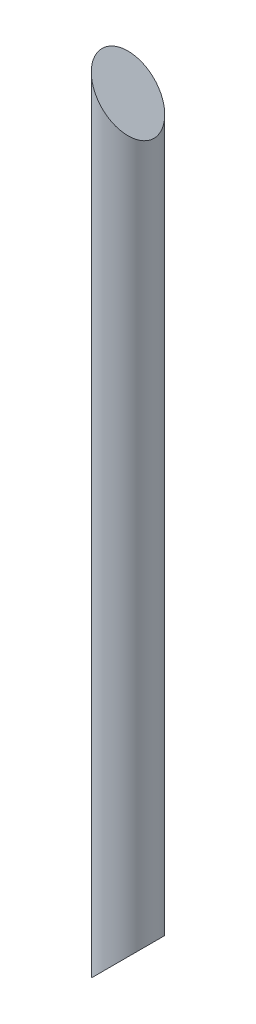
ISO-10303-21;
HEADER;
FILE_DESCRIPTION(('STEP AP214'),'2;1');
FILE_NAME('part.step','',(''),(''),'','','');
FILE_SCHEMA(('AUTOMOTIVE_DESIGN { 1 0 10303 214 1 1 1 1 }'));
ENDSEC;
DATA;
#1=APPLICATION_CONTEXT('core data for automotive mechanical design processes');
#2=APPLICATION_PROTOCOL_DEFINITION('international standard','automotive_design',2000,#1);
#3=PRODUCT_CONTEXT('',#1,'mechanical');
#4=PRODUCT('Part','Part','',(#3));
#5=PRODUCT_RELATED_PRODUCT_CATEGORY('part','',(#4));
#6=PRODUCT_DEFINITION_FORMATION('','',#4);
#7=PRODUCT_DEFINITION_CONTEXT('part definition',#1,'design');
#8=PRODUCT_DEFINITION('design','',#6,#7);
#9=PRODUCT_DEFINITION_SHAPE('','',#8);
#10=(LENGTH_UNIT() NAMED_UNIT(*) SI_UNIT(.MILLI.,.METRE.));
#11=(NAMED_UNIT(*) PLANE_ANGLE_UNIT() SI_UNIT($,.RADIAN.));
#12=(NAMED_UNIT(*) SI_UNIT($,.STERADIAN.) SOLID_ANGLE_UNIT());
#13=UNCERTAINTY_MEASURE_WITH_UNIT(LENGTH_MEASURE(1.E-05),#10,'distance_accuracy_value','');
#14=(GEOMETRIC_REPRESENTATION_CONTEXT(3) GLOBAL_UNCERTAINTY_ASSIGNED_CONTEXT((#13)) GLOBAL_UNIT_ASSIGNED_CONTEXT((#10,
#11,#12)) REPRESENTATION_CONTEXT('',''));
#15=CARTESIAN_POINT('',(0.,0.,0.));
#16=DIRECTION('',(0.,0.,1.));
#17=DIRECTION('',(1.,0.,0.));
#18=AXIS2_PLACEMENT_3D('',#15,#16,#17);
#19=CARTESIAN_POINT('',(0.,850.9,0.));
#20=DIRECTION('',(0.,-1.,0.));
#21=DIRECTION('',(0.,0.,-1.));
#22=AXIS2_PLACEMENT_3D('',#19,#20,#21);
#23=CYLINDRICAL_SURFACE('',#22,31.75);
#24=CARTESIAN_POINT('',(0.,-31.7500000000001,0.));
#25=DIRECTION('',(-0.707106781186548,0.707106781186548,0.));
#26=DIRECTION('',(-0.707106781186547,-0.707106781186548,0.));
#27=AXIS2_PLACEMENT_3D('',#24,#25,#26);
#28=ELLIPSE('',#27,44.9012806053458,31.75);
#29=CARTESIAN_POINT('',(-31.75,-63.5000000000001,0.));
#30=VERTEX_POINT('',#29);
#31=EDGE_CURVE('E10',#30,#30,#28,.T.);
#32=ORIENTED_EDGE('',*,*,#31,.T.);
#33=EDGE_LOOP('',(#32));
#34=FACE_BOUND('',#33,.T.);
#35=CARTESIAN_POINT('',(0.,882.65,0.));
#36=DIRECTION('',(0.707106781186551,0.707106781186544,0.));
#37=DIRECTION('',(0.707106781186544,-0.707106781186551,0.));
#38=AXIS2_PLACEMENT_3D('',#35,#36,#37);
#39=ELLIPSE('',#38,44.901280605346,31.75);
#40=CARTESIAN_POINT('',(31.75,850.9,0.));
#41=VERTEX_POINT('',#40);
#42=EDGE_CURVE('E38',#41,#41,#39,.T.);
#43=ORIENTED_EDGE('',*,*,#42,.F.);
#44=EDGE_LOOP('',(#43));
#45=FACE_BOUND('',#44,.T.);
#46=ADVANCED_FACE('F32',(#34,#45),#23,.T.);
#47=CARTESIAN_POINT('',(15.875,-15.875,96.774));
#48=DIRECTION('',(-0.707106781186548,0.707106781186548,0.));
#49=DIRECTION('',(-0.707106781186547,-0.707106781186548,0.));
#50=AXIS2_PLACEMENT_3D('',#47,#48,#49);
#51=PLANE('',#50);
#52=ORIENTED_EDGE('',*,*,#31,.F.);
#53=EDGE_LOOP('',(#52));
#54=FACE_BOUND('',#53,.T.);
#55=ADVANCED_FACE('F47',(#54),#51,.F.);
#56=CARTESIAN_POINT('',(441.325,441.324999999996,96.774));
#57=DIRECTION('',(0.707106781186551,0.707106781186544,0.));
#58=DIRECTION('',(-0.707106781186544,0.707106781186551,0.));
#59=AXIS2_PLACEMENT_3D('',#56,#57,#58);
#60=PLANE('',#59);
#61=ORIENTED_EDGE('',*,*,#42,.T.);
#62=EDGE_LOOP('',(#61));
#63=FACE_BOUND('',#62,.T.);
#64=ADVANCED_FACE('F44',(#63),#60,.T.);
#65=CLOSED_SHELL('',(#46,#55,#64));
#66=MANIFOLD_SOLID_BREP('B2',#65);
#67=ADVANCED_BREP_SHAPE_REPRESENTATION('',(#18,#66),#14);
#68=SHAPE_DEFINITION_REPRESENTATION(#9,#67);
ENDSEC;
END-ISO-10303-21;
